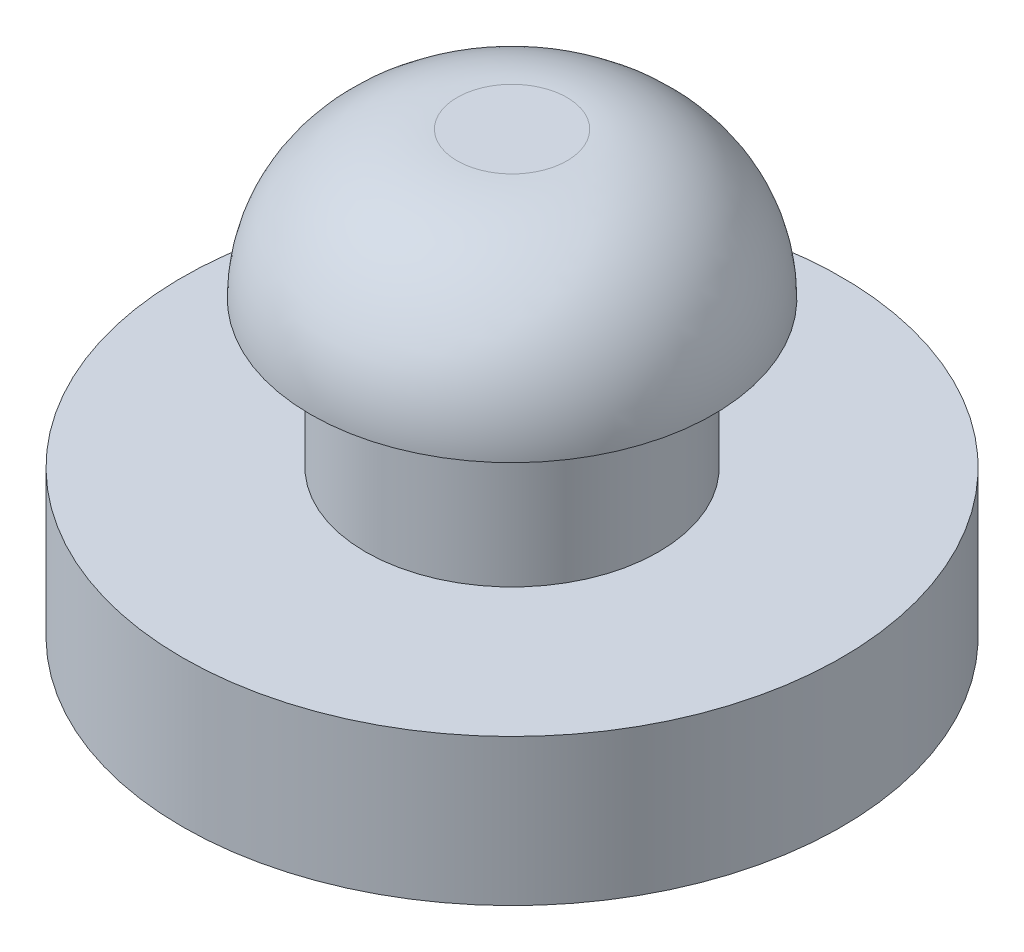
ISO-10303-21;
HEADER;
FILE_DESCRIPTION(('STEP AP214'),'2;1');
FILE_NAME('part.step','',(''),(''),'','','');
FILE_SCHEMA(('AUTOMOTIVE_DESIGN { 1 0 10303 214 1 1 1 1 }'));
ENDSEC;
DATA;
#1=APPLICATION_CONTEXT('core data for automotive mechanical design processes');
#2=APPLICATION_PROTOCOL_DEFINITION('international standard','automotive_design',2000,#1);
#3=PRODUCT_CONTEXT('',#1,'mechanical');
#4=PRODUCT('Part','Part','',(#3));
#5=PRODUCT_RELATED_PRODUCT_CATEGORY('part','',(#4));
#6=PRODUCT_DEFINITION_FORMATION('','',#4);
#7=PRODUCT_DEFINITION_CONTEXT('part definition',#1,'design');
#8=PRODUCT_DEFINITION('design','',#6,#7);
#9=PRODUCT_DEFINITION_SHAPE('','',#8);
#10=(LENGTH_UNIT() NAMED_UNIT(*) SI_UNIT(.MILLI.,.METRE.));
#11=(NAMED_UNIT(*) PLANE_ANGLE_UNIT() SI_UNIT($,.RADIAN.));
#12=(NAMED_UNIT(*) SI_UNIT($,.STERADIAN.) SOLID_ANGLE_UNIT());
#13=UNCERTAINTY_MEASURE_WITH_UNIT(LENGTH_MEASURE(1.E-05),#10,'distance_accuracy_value','');
#14=(GEOMETRIC_REPRESENTATION_CONTEXT(3) GLOBAL_UNCERTAINTY_ASSIGNED_CONTEXT((#13)) GLOBAL_UNIT_ASSIGNED_CONTEXT((#10,
#11,#12)) REPRESENTATION_CONTEXT('',''));
#15=CARTESIAN_POINT('',(0.,0.,0.));
#16=DIRECTION('',(0.,0.,1.));
#17=DIRECTION('',(1.,0.,0.));
#18=AXIS2_PLACEMENT_3D('',#15,#16,#17);
#19=CARTESIAN_POINT('',(0.,3.175,0.));
#20=DIRECTION('',(0.,-1.,0.));
#21=DIRECTION('',(0.,0.,-1.));
#22=AXIS2_PLACEMENT_3D('',#19,#20,#21);
#23=CYLINDRICAL_SURFACE('',#22,7.14375);
#24=CARTESIAN_POINT('',(0.,3.175,0.));
#25=DIRECTION('',(0.,1.,0.));
#26=DIRECTION('',(0.,0.,1.));
#27=AXIS2_PLACEMENT_3D('',#24,#25,#26);
#28=CIRCLE('',#27,7.14375);
#29=CARTESIAN_POINT('',(0.,3.175,7.14375));
#30=VERTEX_POINT('',#29);
#31=EDGE_CURVE('E46',#30,#30,#28,.T.);
#32=ORIENTED_EDGE('',*,*,#31,.F.);
#33=EDGE_LOOP('',(#32));
#34=FACE_BOUND('',#33,.T.);
#35=CARTESIAN_POINT('',(0.,0.,0.));
#36=DIRECTION('',(0.,1.,0.));
#37=DIRECTION('',(0.,0.,1.));
#38=AXIS2_PLACEMENT_3D('',#35,#36,#37);
#39=CIRCLE('',#38,7.14375);
#40=CARTESIAN_POINT('',(0.,0.,7.14375));
#41=VERTEX_POINT('',#40);
#42=EDGE_CURVE('E51',#41,#41,#39,.T.);
#43=ORIENTED_EDGE('',*,*,#42,.T.);
#44=EDGE_LOOP('',(#43));
#45=FACE_BOUND('',#44,.T.);
#46=ADVANCED_FACE('F35',(#34,#45),#23,.T.);
#47=CARTESIAN_POINT('',(0.,3.175,0.));
#48=DIRECTION('',(0.,1.,0.));
#49=DIRECTION('',(0.,0.,1.));
#50=AXIS2_PLACEMENT_3D('',#47,#48,#49);
#51=PLANE('',#50);
#52=CARTESIAN_POINT('',(0.,3.175,0.));
#53=DIRECTION('',(0.,1.,0.));
#54=DIRECTION('',(0.,0.,1.));
#55=AXIS2_PLACEMENT_3D('',#52,#53,#54);
#56=CIRCLE('',#55,3.175);
#57=CARTESIAN_POINT('',(0.,3.175,3.175));
#58=VERTEX_POINT('',#57);
#59=EDGE_CURVE('E42',#58,#58,#56,.T.);
#60=ORIENTED_EDGE('',*,*,#59,.F.);
#61=EDGE_LOOP('',(#60));
#62=FACE_BOUND('',#61,.T.);
#63=ORIENTED_EDGE('',*,*,#31,.T.);
#64=EDGE_LOOP('',(#63));
#65=FACE_BOUND('',#64,.T.);
#66=ADVANCED_FACE('F80',(#62,#65),#51,.T.);
#67=CARTESIAN_POINT('',(0.,0.,0.));
#68=DIRECTION('',(0.,1.,0.));
#69=DIRECTION('',(0.,0.,1.));
#70=AXIS2_PLACEMENT_3D('',#67,#68,#69);
#71=PLANE('',#70);
#72=ORIENTED_EDGE('',*,*,#42,.F.);
#73=EDGE_LOOP('',(#72));
#74=FACE_BOUND('',#73,.T.);
#75=ADVANCED_FACE('F85',(#74),#71,.F.);
#76=CARTESIAN_POINT('',(0.,6.35,0.));
#77=DIRECTION('',(0.,-1.,0.));
#78=DIRECTION('',(0.,0.,-1.));
#79=AXIS2_PLACEMENT_3D('',#76,#77,#78);
#80=CYLINDRICAL_SURFACE('',#79,3.175);
#81=CARTESIAN_POINT('',(0.,6.35,0.));
#82=DIRECTION('',(0.,1.,0.));
#83=DIRECTION('',(0.,0.,1.));
#84=AXIS2_PLACEMENT_3D('',#81,#82,#83);
#85=CIRCLE('',#84,3.175);
#86=CARTESIAN_POINT('',(0.,6.35,3.175));
#87=VERTEX_POINT('',#86);
#88=EDGE_CURVE('E54',#87,#87,#85,.T.);
#89=ORIENTED_EDGE('',*,*,#88,.F.);
#90=EDGE_LOOP('',(#89));
#91=FACE_BOUND('',#90,.T.);
#92=ORIENTED_EDGE('',*,*,#59,.T.);
#93=EDGE_LOOP('',(#92));
#94=FACE_BOUND('',#93,.T.);
#95=ADVANCED_FACE('F76',(#91,#94),#80,.T.);
#96=CARTESIAN_POINT('',(0.,9.525,0.));
#97=DIRECTION('',(0.,1.,0.));
#98=DIRECTION('',(0.,0.,1.));
#99=AXIS2_PLACEMENT_3D('',#96,#97,#98);
#100=PLANE('',#99);
#101=CARTESIAN_POINT('',(0.,9.525,0.));
#102=DIRECTION('',(0.,1.,0.));
#103=DIRECTION('',(0.,0.,1.));
#104=AXIS2_PLACEMENT_3D('',#101,#102,#103);
#105=CIRCLE('',#104,1.190625);
#106=CARTESIAN_POINT('',(0.,9.525,1.190625));
#107=VERTEX_POINT('',#106);
#108=EDGE_CURVE('E10',#107,#107,#105,.T.);
#109=ORIENTED_EDGE('',*,*,#108,.T.);
#110=EDGE_LOOP('',(#109));
#111=FACE_BOUND('',#110,.T.);
#112=ADVANCED_FACE('F70',(#111),#100,.T.);
#113=CARTESIAN_POINT('',(0.,6.35,0.));
#114=DIRECTION('',(0.,1.,0.));
#115=DIRECTION('',(0.,0.,1.));
#116=AXIS2_PLACEMENT_3D('',#113,#114,#115);
#117=PLANE('',#116);
#118=ORIENTED_EDGE('',*,*,#88,.T.);
#119=EDGE_LOOP('',(#118));
#120=FACE_BOUND('',#119,.T.);
#121=CARTESIAN_POINT('',(0.,6.35,0.));
#122=DIRECTION('',(0.,1.,0.));
#123=DIRECTION('',(0.,0.,1.));
#124=AXIS2_PLACEMENT_3D('',#121,#122,#123);
#125=CIRCLE('',#124,4.365625);
#126=CARTESIAN_POINT('',(0.,6.35,4.365625));
#127=VERTEX_POINT('',#126);
#128=EDGE_CURVE('E60',#127,#127,#125,.T.);
#129=ORIENTED_EDGE('',*,*,#128,.F.);
#130=EDGE_LOOP('',(#129));
#131=FACE_BOUND('',#130,.T.);
#132=ADVANCED_FACE('F68',(#120,#131),#117,.F.);
#133=CARTESIAN_POINT('',(0.,6.35,0.));
#134=DIRECTION('',(0.,1.,0.));
#135=DIRECTION('',(0.,0.,1.));
#136=AXIS2_PLACEMENT_3D('',#133,#134,#135);
#137=DEGENERATE_TOROIDAL_SURFACE('',#136,1.190625,3.175,.T.);
#138=ORIENTED_EDGE('',*,*,#128,.T.);
#139=EDGE_LOOP('',(#138));
#140=FACE_BOUND('',#139,.T.);
#141=ORIENTED_EDGE('',*,*,#108,.F.);
#142=EDGE_LOOP('',(#141));
#143=FACE_BOUND('',#142,.T.);
#144=ADVANCED_FACE('F37',(#140,#143),#137,.T.);
#145=CLOSED_SHELL('',(#46,#66,#75,#95,#112,#132,#144));
#146=MANIFOLD_SOLID_BREP('B2',#145);
#147=ADVANCED_BREP_SHAPE_REPRESENTATION('',(#18,#146),#14);
#148=SHAPE_DEFINITION_REPRESENTATION(#9,#147);
ENDSEC;
END-ISO-10303-21;
